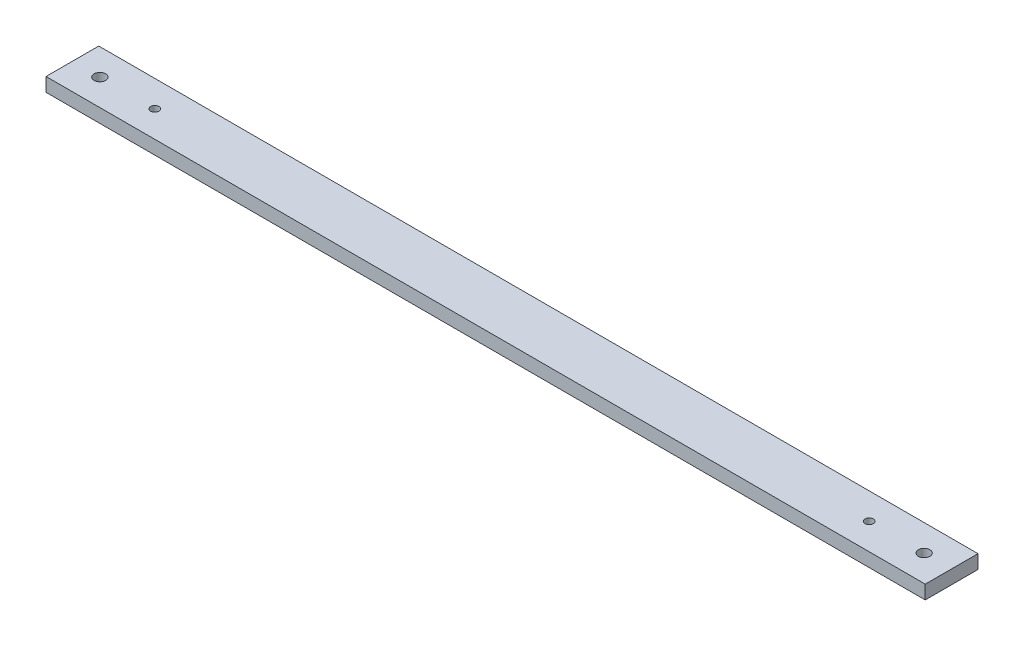
ISO-10303-21;
HEADER;
FILE_DESCRIPTION(('STEP AP214'),'2;1');
FILE_NAME('part.step','',(''),(''),'','','');
FILE_SCHEMA(('AUTOMOTIVE_DESIGN { 1 0 10303 214 1 1 1 1 }'));
ENDSEC;
DATA;
#1=APPLICATION_CONTEXT('core data for automotive mechanical design processes');
#2=APPLICATION_PROTOCOL_DEFINITION('international standard','automotive_design',2000,#1);
#3=PRODUCT_CONTEXT('',#1,'mechanical');
#4=PRODUCT('Part','Part','',(#3));
#5=PRODUCT_RELATED_PRODUCT_CATEGORY('part','',(#4));
#6=PRODUCT_DEFINITION_FORMATION('','',#4);
#7=PRODUCT_DEFINITION_CONTEXT('part definition',#1,'design');
#8=PRODUCT_DEFINITION('design','',#6,#7);
#9=PRODUCT_DEFINITION_SHAPE('','',#8);
#10=(LENGTH_UNIT() NAMED_UNIT(*) SI_UNIT(.MILLI.,.METRE.));
#11=(NAMED_UNIT(*) PLANE_ANGLE_UNIT() SI_UNIT($,.RADIAN.));
#12=(NAMED_UNIT(*) SI_UNIT($,.STERADIAN.) SOLID_ANGLE_UNIT());
#13=UNCERTAINTY_MEASURE_WITH_UNIT(LENGTH_MEASURE(1.E-05),#10,'distance_accuracy_value','');
#14=(GEOMETRIC_REPRESENTATION_CONTEXT(3) GLOBAL_UNCERTAINTY_ASSIGNED_CONTEXT((#13)) GLOBAL_UNIT_ASSIGNED_CONTEXT((#10,
#11,#12)) REPRESENTATION_CONTEXT('',''));
#15=CARTESIAN_POINT('',(0.,0.,0.));
#16=DIRECTION('',(0.,0.,1.));
#17=DIRECTION('',(1.,0.,0.));
#18=AXIS2_PLACEMENT_3D('',#15,#16,#17);
#19=CARTESIAN_POINT('',(0.,5.,0.));
#20=DIRECTION('',(0.,-1.,0.));
#21=DIRECTION('',(0.,0.,-1.));
#22=AXIS2_PLACEMENT_3D('',#19,#20,#21);
#23=PLANE('',#22);
#24=DIRECTION('',(0.,0.,1.));
#25=VECTOR('',#24,1.);
#26=CARTESIAN_POINT('',(-160.,5.,-9.59999999999994));
#27=LINE('',#26,#25);
#28=CARTESIAN_POINT('',(-160.,5.,-9.59999999999994));
#29=VERTEX_POINT('',#28);
#30=CARTESIAN_POINT('',(-160.,5.,9.60000000000002));
#31=VERTEX_POINT('',#30);
#32=EDGE_CURVE('E85',#29,#31,#27,.T.);
#33=ORIENTED_EDGE('',*,*,#32,.T.);
#34=DIRECTION('',(1.,0.,0.));
#35=VECTOR('',#34,1.);
#36=CARTESIAN_POINT('',(160.,5.,9.59999999999994));
#37=LINE('',#36,#35);
#38=CARTESIAN_POINT('',(160.,5.,9.59999999999994));
#39=VERTEX_POINT('',#38);
#40=EDGE_CURVE('E80',#31,#39,#37,.T.);
#41=ORIENTED_EDGE('',*,*,#40,.T.);
#42=DIRECTION('',(0.,0.,-1.));
#43=VECTOR('',#42,1.);
#44=CARTESIAN_POINT('',(160.,5.,-9.60000000000006));
#45=LINE('',#44,#43);
#46=CARTESIAN_POINT('',(160.,5.,-9.60000000000006));
#47=VERTEX_POINT('',#46);
#48=EDGE_CURVE('E83',#39,#47,#45,.T.);
#49=ORIENTED_EDGE('',*,*,#48,.T.);
#50=DIRECTION('',(-1.,0.,0.));
#51=VECTOR('',#50,1.);
#52=CARTESIAN_POINT('',(160.,5.,-9.60000000000006));
#53=LINE('',#52,#51);
#54=EDGE_CURVE('E50',#47,#29,#53,.T.);
#55=ORIENTED_EDGE('',*,*,#54,.T.);
#56=EDGE_LOOP('',(#33,#41,#49,#55));
#57=FACE_BOUND('',#56,.T.);
#58=CARTESIAN_POINT('',(130.,5.,0.));
#59=DIRECTION('',(0.,1.,0.));
#60=DIRECTION('',(0.,0.,1.));
#61=AXIS2_PLACEMENT_3D('',#58,#59,#60);
#62=CIRCLE('',#61,1.5);
#63=CARTESIAN_POINT('',(130.,5.,1.5));
#64=VERTEX_POINT('',#63);
#65=EDGE_CURVE('E100',#64,#64,#62,.T.);
#66=ORIENTED_EDGE('',*,*,#65,.F.);
#67=EDGE_LOOP('',(#66));
#68=FACE_BOUND('',#67,.T.);
#69=CARTESIAN_POINT('',(-130.,5.,0.));
#70=DIRECTION('',(0.,1.,0.));
#71=DIRECTION('',(0.,0.,-1.));
#72=AXIS2_PLACEMENT_3D('',#69,#70,#71);
#73=CIRCLE('',#72,1.5);
#74=CARTESIAN_POINT('',(-130.,5.,-1.49999999999999));
#75=VERTEX_POINT('',#74);
#76=EDGE_CURVE('E115',#75,#75,#73,.T.);
#77=ORIENTED_EDGE('',*,*,#76,.F.);
#78=EDGE_LOOP('',(#77));
#79=FACE_BOUND('',#78,.T.);
#80=CARTESIAN_POINT('',(150.,5.,0.));
#81=DIRECTION('',(0.,1.,0.));
#82=DIRECTION('',(0.,0.,1.));
#83=AXIS2_PLACEMENT_3D('',#80,#81,#82);
#84=CIRCLE('',#83,2.10000000000002);
#85=CARTESIAN_POINT('',(150.,5.,2.10000000000002));
#86=VERTEX_POINT('',#85);
#87=EDGE_CURVE('E121',#86,#86,#84,.T.);
#88=ORIENTED_EDGE('',*,*,#87,.F.);
#89=EDGE_LOOP('',(#88));
#90=FACE_BOUND('',#89,.T.);
#91=CARTESIAN_POINT('',(-150.,5.,0.));
#92=DIRECTION('',(0.,1.,0.));
#93=DIRECTION('',(0.,0.,-1.));
#94=AXIS2_PLACEMENT_3D('',#91,#92,#93);
#95=CIRCLE('',#94,2.10000000000002);
#96=CARTESIAN_POINT('',(-150.,5.,-2.10000000000002));
#97=VERTEX_POINT('',#96);
#98=EDGE_CURVE('E127',#97,#97,#95,.T.);
#99=ORIENTED_EDGE('',*,*,#98,.F.);
#100=EDGE_LOOP('',(#99));
#101=FACE_BOUND('',#100,.T.);
#102=ADVANCED_FACE('F33',(#57,#68,#79,#90,#101),#23,.F.);
#103=CARTESIAN_POINT('',(0.,0.,0.));
#104=DIRECTION('',(0.,-1.,0.));
#105=DIRECTION('',(0.,0.,-1.));
#106=AXIS2_PLACEMENT_3D('',#103,#104,#105);
#107=PLANE('',#106);
#108=CARTESIAN_POINT('',(150.,0.,0.));
#109=DIRECTION('',(0.,1.,0.));
#110=DIRECTION('',(0.,0.,1.));
#111=AXIS2_PLACEMENT_3D('',#108,#109,#110);
#112=CIRCLE('',#111,2.10000000000002);
#113=CARTESIAN_POINT('',(150.,0.,2.10000000000002));
#114=VERTEX_POINT('',#113);
#115=EDGE_CURVE('E124',#114,#114,#112,.T.);
#116=ORIENTED_EDGE('',*,*,#115,.T.);
#117=EDGE_LOOP('',(#116));
#118=FACE_BOUND('',#117,.T.);
#119=CARTESIAN_POINT('',(130.,0.,0.));
#120=DIRECTION('',(0.,1.,0.));
#121=DIRECTION('',(0.,0.,1.));
#122=AXIS2_PLACEMENT_3D('',#119,#120,#121);
#123=CIRCLE('',#122,1.5);
#124=CARTESIAN_POINT('',(130.,0.,1.5));
#125=VERTEX_POINT('',#124);
#126=EDGE_CURVE('E112',#125,#125,#123,.T.);
#127=ORIENTED_EDGE('',*,*,#126,.T.);
#128=EDGE_LOOP('',(#127));
#129=FACE_BOUND('',#128,.T.);
#130=DIRECTION('',(0.,0.,1.));
#131=VECTOR('',#130,1.);
#132=CARTESIAN_POINT('',(-160.,0.,-9.59999999999994));
#133=LINE('',#132,#131);
#134=CARTESIAN_POINT('',(-160.,0.,-9.59999999999994));
#135=VERTEX_POINT('',#134);
#136=CARTESIAN_POINT('',(-160.,0.,9.60000000000002));
#137=VERTEX_POINT('',#136);
#138=EDGE_CURVE('E97',#135,#137,#133,.T.);
#139=ORIENTED_EDGE('',*,*,#138,.F.);
#140=DIRECTION('',(-1.,0.,0.));
#141=VECTOR('',#140,1.);
#142=CARTESIAN_POINT('',(160.,0.,-9.60000000000006));
#143=LINE('',#142,#141);
#144=CARTESIAN_POINT('',(160.,0.,-9.60000000000006));
#145=VERTEX_POINT('',#144);
#146=EDGE_CURVE('E73',#145,#135,#143,.T.);
#147=ORIENTED_EDGE('',*,*,#146,.F.);
#148=DIRECTION('',(0.,0.,-1.));
#149=VECTOR('',#148,1.);
#150=CARTESIAN_POINT('',(160.,0.,-9.60000000000006));
#151=LINE('',#150,#149);
#152=CARTESIAN_POINT('',(160.,0.,9.59999999999994));
#153=VERTEX_POINT('',#152);
#154=EDGE_CURVE('E67',#153,#145,#151,.T.);
#155=ORIENTED_EDGE('',*,*,#154,.F.);
#156=DIRECTION('',(1.,0.,0.));
#157=VECTOR('',#156,1.);
#158=CARTESIAN_POINT('',(160.,0.,9.59999999999994));
#159=LINE('',#158,#157);
#160=EDGE_CURVE('E89',#137,#153,#159,.T.);
#161=ORIENTED_EDGE('',*,*,#160,.F.);
#162=EDGE_LOOP('',(#139,#147,#155,#161));
#163=FACE_BOUND('',#162,.T.);
#164=CARTESIAN_POINT('',(-130.,0.,0.));
#165=DIRECTION('',(0.,1.,0.));
#166=DIRECTION('',(0.,0.,-1.));
#167=AXIS2_PLACEMENT_3D('',#164,#165,#166);
#168=CIRCLE('',#167,1.5);
#169=CARTESIAN_POINT('',(-130.,0.,-1.49999999999999));
#170=VERTEX_POINT('',#169);
#171=EDGE_CURVE('E118',#170,#170,#168,.T.);
#172=ORIENTED_EDGE('',*,*,#171,.T.);
#173=EDGE_LOOP('',(#172));
#174=FACE_BOUND('',#173,.T.);
#175=CARTESIAN_POINT('',(-150.,0.,0.));
#176=DIRECTION('',(0.,1.,0.));
#177=DIRECTION('',(0.,0.,-1.));
#178=AXIS2_PLACEMENT_3D('',#175,#176,#177);
#179=CIRCLE('',#178,2.10000000000002);
#180=CARTESIAN_POINT('',(-150.,0.,-2.10000000000002));
#181=VERTEX_POINT('',#180);
#182=EDGE_CURVE('E130',#181,#181,#179,.T.);
#183=ORIENTED_EDGE('',*,*,#182,.T.);
#184=EDGE_LOOP('',(#183));
#185=FACE_BOUND('',#184,.T.);
#186=ADVANCED_FACE('F108',(#118,#129,#163,#174,#185),#107,.T.);
#187=CARTESIAN_POINT('',(-160.,5.,-9.59999999999994));
#188=DIRECTION('',(1.,0.,0.));
#189=DIRECTION('',(0.,0.,-1.));
#190=AXIS2_PLACEMENT_3D('',#187,#188,#189);
#191=PLANE('',#190);
#192=ORIENTED_EDGE('',*,*,#138,.T.);
#193=DIRECTION('',(0.,-1.,0.));
#194=VECTOR('',#193,1.);
#195=CARTESIAN_POINT('',(-160.,5.,9.60000000000002));
#196=LINE('',#195,#194);
#197=EDGE_CURVE('E11',#31,#137,#196,.T.);
#198=ORIENTED_EDGE('',*,*,#197,.F.);
#199=ORIENTED_EDGE('',*,*,#32,.F.);
#200=DIRECTION('',(0.,-1.,0.));
#201=VECTOR('',#200,1.);
#202=CARTESIAN_POINT('',(-160.,5.,-9.59999999999994));
#203=LINE('',#202,#201);
#204=EDGE_CURVE('E93',#29,#135,#203,.T.);
#205=ORIENTED_EDGE('',*,*,#204,.T.);
#206=EDGE_LOOP('',(#192,#198,#199,#205));
#207=FACE_BOUND('',#206,.T.);
#208=ADVANCED_FACE('F35',(#207),#191,.F.);
#209=CARTESIAN_POINT('',(160.,5.,9.59999999999994));
#210=DIRECTION('',(0.,0.,-1.));
#211=DIRECTION('',(-1.,0.,0.));
#212=AXIS2_PLACEMENT_3D('',#209,#210,#211);
#213=PLANE('',#212);
#214=ORIENTED_EDGE('',*,*,#160,.T.);
#215=DIRECTION('',(0.,-1.,0.));
#216=VECTOR('',#215,1.);
#217=CARTESIAN_POINT('',(160.,5.,9.59999999999994));
#218=LINE('',#217,#216);
#219=EDGE_CURVE('E42',#39,#153,#218,.T.);
#220=ORIENTED_EDGE('',*,*,#219,.F.);
#221=ORIENTED_EDGE('',*,*,#40,.F.);
#222=ORIENTED_EDGE('',*,*,#197,.T.);
#223=EDGE_LOOP('',(#214,#220,#221,#222));
#224=FACE_BOUND('',#223,.T.);
#225=ADVANCED_FACE('F88',(#224),#213,.F.);
#226=CARTESIAN_POINT('',(160.,5.,-9.60000000000006));
#227=DIRECTION('',(-1.,0.,0.));
#228=DIRECTION('',(0.,0.,1.));
#229=AXIS2_PLACEMENT_3D('',#226,#227,#228);
#230=PLANE('',#229);
#231=ORIENTED_EDGE('',*,*,#154,.T.);
#232=DIRECTION('',(0.,-1.,0.));
#233=VECTOR('',#232,1.);
#234=CARTESIAN_POINT('',(160.,5.,-9.60000000000006));
#235=LINE('',#234,#233);
#236=EDGE_CURVE('E90',#47,#145,#235,.T.);
#237=ORIENTED_EDGE('',*,*,#236,.F.);
#238=ORIENTED_EDGE('',*,*,#48,.F.);
#239=ORIENTED_EDGE('',*,*,#219,.T.);
#240=EDGE_LOOP('',(#231,#237,#238,#239));
#241=FACE_BOUND('',#240,.T.);
#242=ADVANCED_FACE('F91',(#241),#230,.F.);
#243=CARTESIAN_POINT('',(160.,5.,-9.60000000000006));
#244=DIRECTION('',(0.,0.,1.));
#245=DIRECTION('',(1.,0.,0.));
#246=AXIS2_PLACEMENT_3D('',#243,#244,#245);
#247=PLANE('',#246);
#248=ORIENTED_EDGE('',*,*,#146,.T.);
#249=ORIENTED_EDGE('',*,*,#204,.F.);
#250=ORIENTED_EDGE('',*,*,#54,.F.);
#251=ORIENTED_EDGE('',*,*,#236,.T.);
#252=EDGE_LOOP('',(#248,#249,#250,#251));
#253=FACE_BOUND('',#252,.T.);
#254=ADVANCED_FACE('F105',(#253),#247,.F.);
#255=CARTESIAN_POINT('',(130.,5.,0.));
#256=DIRECTION('',(0.,-1.,0.));
#257=DIRECTION('',(0.,0.,-1.));
#258=AXIS2_PLACEMENT_3D('',#255,#256,#257);
#259=CYLINDRICAL_SURFACE('',#258,1.5);
#260=ORIENTED_EDGE('',*,*,#65,.T.);
#261=EDGE_LOOP('',(#260));
#262=FACE_BOUND('',#261,.T.);
#263=ORIENTED_EDGE('',*,*,#126,.F.);
#264=EDGE_LOOP('',(#263));
#265=FACE_BOUND('',#264,.T.);
#266=ADVANCED_FACE('F147',(#262,#265),#259,.F.);
#267=CARTESIAN_POINT('',(-130.,5.,0.));
#268=DIRECTION('',(0.,-1.,0.));
#269=DIRECTION('',(0.,0.,-1.));
#270=AXIS2_PLACEMENT_3D('',#267,#268,#269);
#271=CYLINDRICAL_SURFACE('',#270,1.5);
#272=ORIENTED_EDGE('',*,*,#76,.T.);
#273=EDGE_LOOP('',(#272));
#274=FACE_BOUND('',#273,.T.);
#275=ORIENTED_EDGE('',*,*,#171,.F.);
#276=EDGE_LOOP('',(#275));
#277=FACE_BOUND('',#276,.T.);
#278=ADVANCED_FACE('F193',(#274,#277),#271,.F.);
#279=CARTESIAN_POINT('',(150.,5.,0.));
#280=DIRECTION('',(0.,-1.,0.));
#281=DIRECTION('',(0.,0.,-1.));
#282=AXIS2_PLACEMENT_3D('',#279,#280,#281);
#283=CYLINDRICAL_SURFACE('',#282,2.10000000000002);
#284=ORIENTED_EDGE('',*,*,#87,.T.);
#285=EDGE_LOOP('',(#284));
#286=FACE_BOUND('',#285,.T.);
#287=ORIENTED_EDGE('',*,*,#115,.F.);
#288=EDGE_LOOP('',(#287));
#289=FACE_BOUND('',#288,.T.);
#290=ADVANCED_FACE('F201',(#286,#289),#283,.F.);
#291=CARTESIAN_POINT('',(-150.,5.,0.));
#292=DIRECTION('',(0.,-1.,0.));
#293=DIRECTION('',(0.,0.,-1.));
#294=AXIS2_PLACEMENT_3D('',#291,#292,#293);
#295=CYLINDRICAL_SURFACE('',#294,2.10000000000002);
#296=ORIENTED_EDGE('',*,*,#98,.T.);
#297=EDGE_LOOP('',(#296));
#298=FACE_BOUND('',#297,.T.);
#299=ORIENTED_EDGE('',*,*,#182,.F.);
#300=EDGE_LOOP('',(#299));
#301=FACE_BOUND('',#300,.T.);
#302=ADVANCED_FACE('F136',(#298,#301),#295,.F.);
#303=CLOSED_SHELL('',(#102,#186,#208,#225,#242,#254,#266,#278,#290,#302));
#304=MANIFOLD_SOLID_BREP('B2',#303);
#305=ADVANCED_BREP_SHAPE_REPRESENTATION('',(#18,#304),#14);
#306=SHAPE_DEFINITION_REPRESENTATION(#9,#305);
ENDSEC;
END-ISO-10303-21;
